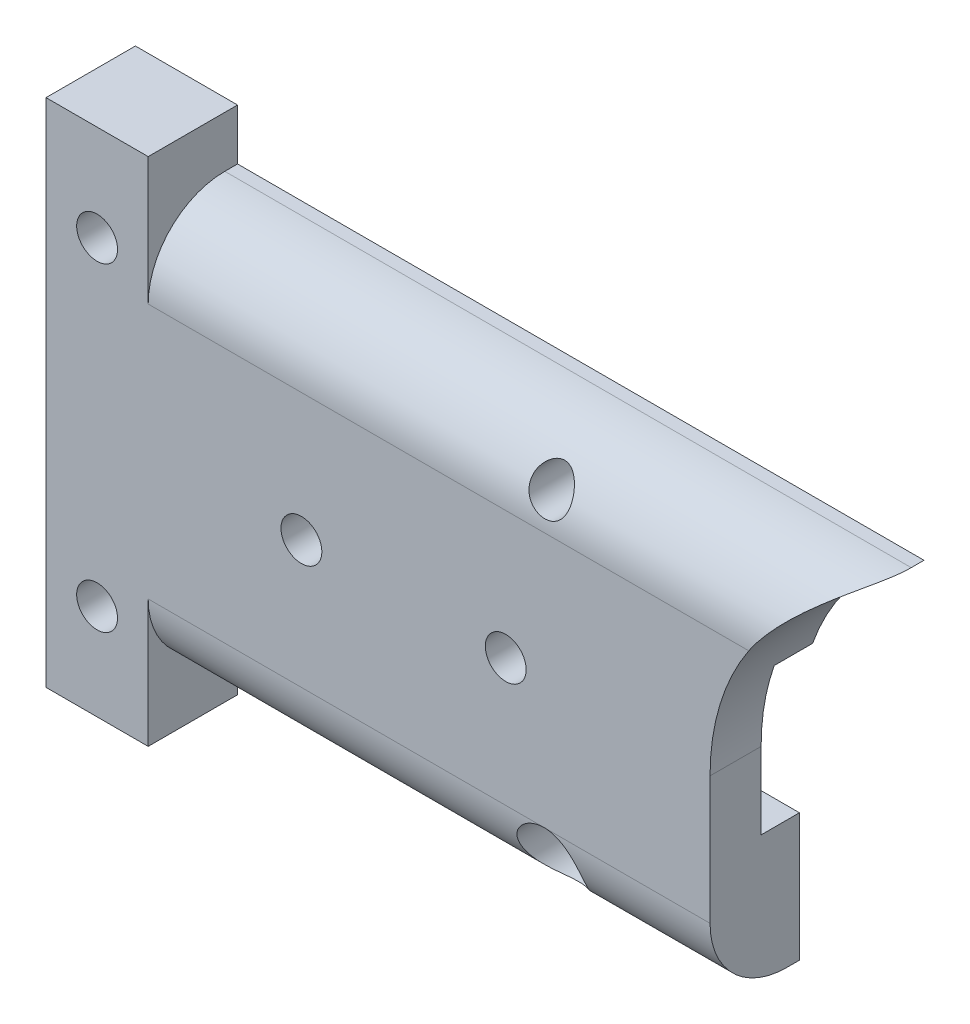
ISO-10303-21;
HEADER;
FILE_DESCRIPTION(('STEP AP214'),'2;1');
FILE_NAME('part.step','',(''),(''),'','','');
FILE_SCHEMA(('AUTOMOTIVE_DESIGN { 1 0 10303 214 1 1 1 1 }'));
ENDSEC;
DATA;
#1=APPLICATION_CONTEXT('core data for automotive mechanical design processes');
#2=APPLICATION_PROTOCOL_DEFINITION('international standard','automotive_design',2000,#1);
#3=PRODUCT_CONTEXT('',#1,'mechanical');
#4=PRODUCT('Part','Part','',(#3));
#5=PRODUCT_RELATED_PRODUCT_CATEGORY('part','',(#4));
#6=PRODUCT_DEFINITION_FORMATION('','',#4);
#7=PRODUCT_DEFINITION_CONTEXT('part definition',#1,'design');
#8=PRODUCT_DEFINITION('design','',#6,#7);
#9=PRODUCT_DEFINITION_SHAPE('','',#8);
#10=(LENGTH_UNIT() NAMED_UNIT(*) SI_UNIT(.MILLI.,.METRE.));
#11=(NAMED_UNIT(*) PLANE_ANGLE_UNIT() SI_UNIT($,.RADIAN.));
#12=(NAMED_UNIT(*) SI_UNIT($,.STERADIAN.) SOLID_ANGLE_UNIT());
#13=UNCERTAINTY_MEASURE_WITH_UNIT(LENGTH_MEASURE(1.E-05),#10,'distance_accuracy_value','');
#14=(GEOMETRIC_REPRESENTATION_CONTEXT(3) GLOBAL_UNCERTAINTY_ASSIGNED_CONTEXT((#13)) GLOBAL_UNIT_ASSIGNED_CONTEXT((#10,
#11,#12)) REPRESENTATION_CONTEXT('',''));
#15=CARTESIAN_POINT('',(0.,0.,0.));
#16=DIRECTION('',(0.,0.,1.));
#17=DIRECTION('',(1.,0.,0.));
#18=AXIS2_PLACEMENT_3D('',#15,#16,#17);
#19=CARTESIAN_POINT('',(29.6612558937557,-6.25,3.5));
#20=DIRECTION('',(0.,0.,-1.));
#21=DIRECTION('',(-1.,0.,0.));
#22=AXIS2_PLACEMENT_3D('',#19,#20,#21);
#23=CYLINDRICAL_SURFACE('',#22,0.800000000000002);
#24=CARTESIAN_POINT('',(29.6612558937557,-6.25,0.));
#25=DIRECTION('',(0.,0.,1.));
#26=DIRECTION('',(1.,0.,0.));
#27=AXIS2_PLACEMENT_3D('',#24,#25,#26);
#28=CIRCLE('',#27,0.800000000000002);
#29=CARTESIAN_POINT('',(30.4612558937557,-6.25,0.));
#30=VERTEX_POINT('',#29);
#31=EDGE_CURVE('E260',#30,#30,#28,.T.);
#32=ORIENTED_EDGE('',*,*,#31,.F.);
#33=EDGE_LOOP('',(#32));
#34=FACE_BOUND('',#33,.T.);
#35=CARTESIAN_POINT('',(29.6612558937557,-6.25,0.5));
#36=DIRECTION('',(0.,0.,1.));
#37=DIRECTION('',(1.,0.,0.));
#38=AXIS2_PLACEMENT_3D('',#35,#36,#37);
#39=CIRCLE('',#38,0.800000000000002);
#40=CARTESIAN_POINT('',(30.4612558937557,-6.25,0.5));
#41=VERTEX_POINT('',#40);
#42=EDGE_CURVE('E40',#41,#41,#39,.T.);
#43=ORIENTED_EDGE('',*,*,#42,.T.);
#44=EDGE_LOOP('',(#43));
#45=FACE_BOUND('',#44,.T.);
#46=ADVANCED_FACE('F35',(#34,#45),#23,.F.);
#47=CARTESIAN_POINT('',(0.,0.,3.5));
#48=DIRECTION('',(0.,0.,1.));
#49=DIRECTION('',(1.,0.,0.));
#50=AXIS2_PLACEMENT_3D('',#47,#48,#49);
#51=PLANE('',#50);
#52=CARTESIAN_POINT('',(12.1612558937557,-6.25,3.5));
#53=DIRECTION('',(0.,0.,1.));
#54=DIRECTION('',(1.,0.,0.));
#55=AXIS2_PLACEMENT_3D('',#52,#53,#54);
#56=CIRCLE('',#55,0.799999999999999);
#57=CARTESIAN_POINT('',(12.9612558937557,-6.25,3.5));
#58=VERTEX_POINT('',#57);
#59=EDGE_CURVE('E395',#58,#58,#56,.T.);
#60=ORIENTED_EDGE('',*,*,#59,.F.);
#61=EDGE_LOOP('',(#60));
#62=FACE_BOUND('',#61,.T.);
#63=CARTESIAN_POINT('',(12.1612558937557,6.25,3.5));
#64=DIRECTION('',(0.,0.,1.));
#65=DIRECTION('',(1.,0.,0.));
#66=AXIS2_PLACEMENT_3D('',#63,#64,#65);
#67=CIRCLE('',#66,0.799999999999999);
#68=CARTESIAN_POINT('',(12.9612558937557,6.25,3.5));
#69=VERTEX_POINT('',#68);
#70=EDGE_CURVE('E408',#69,#69,#67,.T.);
#71=ORIENTED_EDGE('',*,*,#70,.F.);
#72=EDGE_LOOP('',(#71));
#73=FACE_BOUND('',#72,.T.);
#74=DIRECTION('',(0.,1.,0.));
#75=VECTOR('',#74,1.);
#76=CARTESIAN_POINT('',(14.1612558930369,0.,3.5));
#77=LINE('',#76,#75);
#78=CARTESIAN_POINT('',(14.1612558930369,-10.,3.5));
#79=VERTEX_POINT('',#78);
#80=CARTESIAN_POINT('',(14.1612558930369,-5.,3.5));
#81=VERTEX_POINT('',#80);
#82=EDGE_CURVE('E190',#79,#81,#77,.T.);
#83=ORIENTED_EDGE('',*,*,#82,.T.);
#84=DIRECTION('',(1.,0.,0.));
#85=VECTOR('',#84,1.);
#86=CARTESIAN_POINT('',(36.1612558937557,-5.,3.5));
#87=LINE('',#86,#85);
#88=CARTESIAN_POINT('',(29.6612558937557,-5.,3.5));
#89=VERTEX_POINT('',#88);
#90=EDGE_CURVE('E265',#81,#89,#87,.T.);
#91=ORIENTED_EDGE('',*,*,#90,.T.);
#92=CARTESIAN_POINT('',(36.1612558937557,-5.,3.5));
#93=VERTEX_POINT('',#92);
#94=EDGE_CURVE('E264',#89,#93,#87,.T.);
#95=ORIENTED_EDGE('',*,*,#94,.T.);
#96=DIRECTION('',(0.,-1.,0.));
#97=VECTOR('',#96,1.);
#98=CARTESIAN_POINT('',(36.1612558937557,0.,3.5));
#99=LINE('',#98,#97);
#100=CARTESIAN_POINT('',(36.1612558937557,0.,3.5));
#101=VERTEX_POINT('',#100);
#102=EDGE_CURVE('E192',#101,#93,#99,.T.);
#103=ORIENTED_EDGE('',*,*,#102,.F.);
#104=CARTESIAN_POINT('',(45.1612558937557,0.,3.5));
#105=DIRECTION('',(0.,0.,1.));
#106=DIRECTION('',(1.,0.,0.));
#107=AXIS2_PLACEMENT_3D('',#104,#105,#106);
#108=CIRCLE('',#107,9.);
#109=CARTESIAN_POINT('',(37.6779411202078,5.,3.5));
#110=VERTEX_POINT('',#109);
#111=EDGE_CURVE('E195',#110,#101,#108,.T.);
#112=ORIENTED_EDGE('',*,*,#111,.F.);
#113=DIRECTION('',(1.,0.,0.));
#114=VECTOR('',#113,1.);
#115=CARTESIAN_POINT('',(0.,5.,3.5));
#116=LINE('',#115,#114);
#117=CARTESIAN_POINT('',(14.1612558930369,5.,3.5));
#118=VERTEX_POINT('',#117);
#119=EDGE_CURVE('E251',#110,#118,#116,.F.);
#120=ORIENTED_EDGE('',*,*,#119,.T.);
#121=DIRECTION('',(0.,-1.,0.));
#122=VECTOR('',#121,1.);
#123=CARTESIAN_POINT('',(14.1612558930369,0.,3.5));
#124=LINE('',#123,#122);
#125=CARTESIAN_POINT('',(14.1612558930369,10.,3.5));
#126=VERTEX_POINT('',#125);
#127=EDGE_CURVE('E197',#126,#118,#124,.T.);
#128=ORIENTED_EDGE('',*,*,#127,.F.);
#129=DIRECTION('',(1.,0.,0.));
#130=VECTOR('',#129,1.);
#131=CARTESIAN_POINT('',(0.,10.,3.5));
#132=LINE('',#131,#130);
#133=CARTESIAN_POINT('',(10.1612558930369,10.,3.5));
#134=VERTEX_POINT('',#133);
#135=EDGE_CURVE('E199',#134,#126,#132,.T.);
#136=ORIENTED_EDGE('',*,*,#135,.F.);
#137=DIRECTION('',(0.,1.,0.));
#138=VECTOR('',#137,1.);
#139=CARTESIAN_POINT('',(10.1612558930369,0.,3.5));
#140=LINE('',#139,#138);
#141=CARTESIAN_POINT('',(10.1612558930369,-10.,3.5));
#142=VERTEX_POINT('',#141);
#143=EDGE_CURVE('E184',#142,#134,#140,.T.);
#144=ORIENTED_EDGE('',*,*,#143,.F.);
#145=DIRECTION('',(1.,0.,0.));
#146=VECTOR('',#145,1.);
#147=CARTESIAN_POINT('',(0.,-10.,3.5));
#148=LINE('',#147,#146);
#149=EDGE_CURVE('E187',#142,#79,#148,.T.);
#150=ORIENTED_EDGE('',*,*,#149,.T.);
#151=EDGE_LOOP('',(#83,#91,#95,#103,#112,#120,#128,#136,#144,#150));
#152=FACE_BOUND('',#151,.T.);
#153=CARTESIAN_POINT('',(20.1612558937557,0.,3.5));
#154=DIRECTION('',(0.,0.,1.));
#155=DIRECTION('',(1.,0.,0.));
#156=AXIS2_PLACEMENT_3D('',#153,#154,#155);
#157=CIRCLE('',#156,0.799999999999999);
#158=CARTESIAN_POINT('',(20.9612558937557,0.,3.5));
#159=VERTEX_POINT('',#158);
#160=EDGE_CURVE('E256',#159,#159,#157,.T.);
#161=ORIENTED_EDGE('',*,*,#160,.F.);
#162=EDGE_LOOP('',(#161));
#163=FACE_BOUND('',#162,.T.);
#164=CARTESIAN_POINT('',(28.1612558937557,0.,3.5));
#165=DIRECTION('',(0.,0.,1.));
#166=DIRECTION('',(1.,0.,0.));
#167=AXIS2_PLACEMENT_3D('',#164,#165,#166);
#168=CIRCLE('',#167,0.799999999999999);
#169=CARTESIAN_POINT('',(28.9612558937557,0.,3.5));
#170=VERTEX_POINT('',#169);
#171=EDGE_CURVE('E261',#170,#170,#168,.T.);
#172=ORIENTED_EDGE('',*,*,#171,.F.);
#173=EDGE_LOOP('',(#172));
#174=FACE_BOUND('',#173,.T.);
#175=ADVANCED_FACE('F330',(#62,#73,#152,#163,#174),#51,.T.);
#176=CARTESIAN_POINT('',(0.,0.,1.5));
#177=DIRECTION('',(0.,0.,-1.));
#178=DIRECTION('',(-1.,0.,0.));
#179=AXIS2_PLACEMENT_3D('',#176,#177,#178);
#180=PLANE('',#179);
#181=CARTESIAN_POINT('',(20.1612558937557,0.,1.5));
#182=DIRECTION('',(0.,0.,-1.));
#183=DIRECTION('',(-1.,0.,0.));
#184=AXIS2_PLACEMENT_3D('',#181,#182,#183);
#185=CIRCLE('',#184,0.799999999999999);
#186=CARTESIAN_POINT('',(19.3612558937557,0.,1.5));
#187=VERTEX_POINT('',#186);
#188=EDGE_CURVE('E252',#187,#187,#185,.F.);
#189=ORIENTED_EDGE('',*,*,#188,.T.);
#190=EDGE_LOOP('',(#189));
#191=FACE_BOUND('',#190,.T.);
#192=DIRECTION('',(1.,0.,0.));
#193=VECTOR('',#192,1.);
#194=CARTESIAN_POINT('',(38.2873923506031,-3.,1.5));
#195=LINE('',#194,#193);
#196=CARTESIAN_POINT('',(10.1612558930369,-3.,1.5));
#197=VERTEX_POINT('',#196);
#198=CARTESIAN_POINT('',(36.1612558937557,-3.,1.5));
#199=VERTEX_POINT('',#198);
#200=EDGE_CURVE('E164',#197,#199,#195,.T.);
#201=ORIENTED_EDGE('',*,*,#200,.F.);
#202=DIRECTION('',(0.,-1.,0.));
#203=VECTOR('',#202,1.);
#204=CARTESIAN_POINT('',(10.1612558930369,3.,1.5));
#205=LINE('',#204,#203);
#206=CARTESIAN_POINT('',(10.1612558930369,3.,1.5));
#207=VERTEX_POINT('',#206);
#208=EDGE_CURVE('E156',#207,#197,#205,.T.);
#209=ORIENTED_EDGE('',*,*,#208,.F.);
#210=DIRECTION('',(-1.,0.,0.));
#211=VECTOR('',#210,1.);
#212=CARTESIAN_POINT('',(10.1612558930369,3.,1.5));
#213=LINE('',#212,#211);
#214=CARTESIAN_POINT('',(36.6759745195172,3.,1.5));
#215=VERTEX_POINT('',#214);
#216=EDGE_CURVE('E146',#215,#207,#213,.T.);
#217=ORIENTED_EDGE('',*,*,#216,.F.);
#218=CARTESIAN_POINT('',(45.1612558937557,0.,1.5));
#219=DIRECTION('',(0.,0.,-1.));
#220=DIRECTION('',(-1.,0.,0.));
#221=AXIS2_PLACEMENT_3D('',#218,#219,#220);
#222=CIRCLE('',#221,9.);
#223=CARTESIAN_POINT('',(36.1612558937557,0.,1.5));
#224=VERTEX_POINT('',#223);
#225=EDGE_CURVE('E249',#224,#215,#222,.T.);
#226=ORIENTED_EDGE('',*,*,#225,.F.);
#227=DIRECTION('',(0.,1.,0.));
#228=VECTOR('',#227,1.);
#229=CARTESIAN_POINT('',(36.1612558937557,0.,1.5));
#230=LINE('',#229,#228);
#231=EDGE_CURVE('E181',#199,#224,#230,.T.);
#232=ORIENTED_EDGE('',*,*,#231,.F.);
#233=EDGE_LOOP('',(#201,#209,#217,#226,#232));
#234=FACE_BOUND('',#233,.T.);
#235=CARTESIAN_POINT('',(28.1612558937557,0.,1.5));
#236=DIRECTION('',(0.,0.,-1.));
#237=DIRECTION('',(-1.,0.,0.));
#238=AXIS2_PLACEMENT_3D('',#235,#236,#237);
#239=CIRCLE('',#238,0.799999999999999);
#240=CARTESIAN_POINT('',(27.3612558937557,0.,1.5));
#241=VERTEX_POINT('',#240);
#242=EDGE_CURVE('E257',#241,#241,#239,.F.);
#243=ORIENTED_EDGE('',*,*,#242,.T.);
#244=EDGE_LOOP('',(#243));
#245=FACE_BOUND('',#244,.T.);
#246=ADVANCED_FACE('F161',(#191,#234,#245),#180,.T.);
#247=CARTESIAN_POINT('',(0.,0.,0.));
#248=DIRECTION('',(0.,0.,1.));
#249=DIRECTION('',(1.,0.,0.));
#250=AXIS2_PLACEMENT_3D('',#247,#248,#249);
#251=PLANE('',#250);
#252=CARTESIAN_POINT('',(12.1612558937557,-6.25,0.));
#253=DIRECTION('',(0.,0.,1.));
#254=DIRECTION('',(1.,0.,0.));
#255=AXIS2_PLACEMENT_3D('',#252,#253,#254);
#256=CIRCLE('',#255,0.799999999999999);
#257=CARTESIAN_POINT('',(12.9612558937557,-6.25,0.));
#258=VERTEX_POINT('',#257);
#259=EDGE_CURVE('E392',#258,#258,#256,.T.);
#260=ORIENTED_EDGE('',*,*,#259,.T.);
#261=EDGE_LOOP('',(#260));
#262=FACE_BOUND('',#261,.T.);
#263=DIRECTION('',(1.,0.,0.));
#264=VECTOR('',#263,1.);
#265=CARTESIAN_POINT('',(38.2873923506031,-3.,0.));
#266=LINE('',#265,#264);
#267=CARTESIAN_POINT('',(10.1612558930369,-3.,0.));
#268=VERTEX_POINT('',#267);
#269=CARTESIAN_POINT('',(36.1612558937557,-3.,0.));
#270=VERTEX_POINT('',#269);
#271=EDGE_CURVE('E157',#268,#270,#266,.T.);
#272=ORIENTED_EDGE('',*,*,#271,.T.);
#273=DIRECTION('',(0.,-1.,0.));
#274=VECTOR('',#273,1.);
#275=CARTESIAN_POINT('',(36.1612558937557,0.,0.));
#276=LINE('',#275,#274);
#277=CARTESIAN_POINT('',(36.1612558937557,-8.,0.));
#278=VERTEX_POINT('',#277);
#279=EDGE_CURVE('E214',#270,#278,#276,.T.);
#280=ORIENTED_EDGE('',*,*,#279,.T.);
#281=DIRECTION('',(1.,0.,0.));
#282=VECTOR('',#281,1.);
#283=CARTESIAN_POINT('',(0.,-8.,0.));
#284=LINE('',#283,#282);
#285=CARTESIAN_POINT('',(14.1612558930369,-8.,0.));
#286=VERTEX_POINT('',#285);
#287=EDGE_CURVE('E211',#286,#278,#284,.T.);
#288=ORIENTED_EDGE('',*,*,#287,.F.);
#289=DIRECTION('',(0.,1.,0.));
#290=VECTOR('',#289,1.);
#291=CARTESIAN_POINT('',(14.1612558930369,0.,0.));
#292=LINE('',#291,#290);
#293=CARTESIAN_POINT('',(14.1612558930369,-10.,0.));
#294=VERTEX_POINT('',#293);
#295=EDGE_CURVE('E208',#294,#286,#292,.T.);
#296=ORIENTED_EDGE('',*,*,#295,.F.);
#297=DIRECTION('',(1.,0.,0.));
#298=VECTOR('',#297,1.);
#299=CARTESIAN_POINT('',(0.,-10.,0.));
#300=LINE('',#299,#298);
#301=CARTESIAN_POINT('',(10.1612558930369,-10.,0.));
#302=VERTEX_POINT('',#301);
#303=EDGE_CURVE('E206',#302,#294,#300,.T.);
#304=ORIENTED_EDGE('',*,*,#303,.F.);
#305=DIRECTION('',(0.,1.,0.));
#306=VECTOR('',#305,1.);
#307=CARTESIAN_POINT('',(10.1612558930369,0.,0.));
#308=LINE('',#307,#306);
#309=EDGE_CURVE('E203',#302,#268,#308,.T.);
#310=ORIENTED_EDGE('',*,*,#309,.T.);
#311=EDGE_LOOP('',(#272,#280,#288,#296,#304,#310));
#312=FACE_BOUND('',#311,.T.);
#313=ORIENTED_EDGE('',*,*,#31,.T.);
#314=EDGE_LOOP('',(#313));
#315=FACE_BOUND('',#314,.T.);
#316=ADVANCED_FACE('F351',(#262,#312,#315),#251,.F.);
#317=CARTESIAN_POINT('',(12.1612558937557,6.25,0.));
#318=DIRECTION('',(0.,0.,1.));
#319=DIRECTION('',(1.,0.,0.));
#320=AXIS2_PLACEMENT_3D('',#317,#318,#319);
#321=CIRCLE('',#320,0.799999999999999);
#322=CARTESIAN_POINT('',(12.9612558937557,6.25,0.));
#323=VERTEX_POINT('',#322);
#324=EDGE_CURVE('E255',#323,#323,#321,.T.);
#325=ORIENTED_EDGE('',*,*,#324,.T.);
#326=EDGE_LOOP('',(#325));
#327=FACE_BOUND('',#326,.T.);
#328=DIRECTION('',(1.,0.,0.));
#329=VECTOR('',#328,1.);
#330=CARTESIAN_POINT('',(0.,3.,0.));
#331=LINE('',#330,#329);
#332=CARTESIAN_POINT('',(10.1612558930369,3.,0.));
#333=VERTEX_POINT('',#332);
#334=CARTESIAN_POINT('',(36.6759745195172,3.,0.));
#335=VERTEX_POINT('',#334);
#336=EDGE_CURVE('E247',#333,#335,#331,.T.);
#337=ORIENTED_EDGE('',*,*,#336,.F.);
#338=CARTESIAN_POINT('',(10.1612558930369,10.,0.));
#339=VERTEX_POINT('',#338);
#340=EDGE_CURVE('E171',#333,#339,#308,.T.);
#341=ORIENTED_EDGE('',*,*,#340,.T.);
#342=DIRECTION('',(1.,0.,0.));
#343=VECTOR('',#342,1.);
#344=CARTESIAN_POINT('',(0.,10.,0.));
#345=LINE('',#344,#343);
#346=CARTESIAN_POINT('',(14.1612558930369,10.,0.));
#347=VERTEX_POINT('',#346);
#348=EDGE_CURVE('E188',#339,#347,#345,.T.);
#349=ORIENTED_EDGE('',*,*,#348,.T.);
#350=DIRECTION('',(0.,-1.,0.));
#351=VECTOR('',#350,1.);
#352=CARTESIAN_POINT('',(14.1612558930369,0.,0.));
#353=LINE('',#352,#351);
#354=CARTESIAN_POINT('',(14.1612558930369,8.,0.));
#355=VERTEX_POINT('',#354);
#356=EDGE_CURVE('E223',#347,#355,#353,.T.);
#357=ORIENTED_EDGE('',*,*,#356,.T.);
#358=DIRECTION('',(1.,0.,0.));
#359=VECTOR('',#358,1.);
#360=CARTESIAN_POINT('',(0.,8.,0.));
#361=LINE('',#360,#359);
#362=CARTESIAN_POINT('',(41.0381502681381,8.,0.));
#363=VERTEX_POINT('',#362);
#364=EDGE_CURVE('E220',#355,#363,#361,.T.);
#365=ORIENTED_EDGE('',*,*,#364,.T.);
#366=CARTESIAN_POINT('',(45.1612558937557,0.,0.));
#367=DIRECTION('',(0.,0.,1.));
#368=DIRECTION('',(1.,0.,0.));
#369=AXIS2_PLACEMENT_3D('',#366,#367,#368);
#370=CIRCLE('',#369,9.);
#371=EDGE_CURVE('E217',#363,#335,#370,.T.);
#372=ORIENTED_EDGE('',*,*,#371,.T.);
#373=EDGE_LOOP('',(#337,#341,#349,#357,#365,#372));
#374=FACE_BOUND('',#373,.T.);
#375=CARTESIAN_POINT('',(29.6612558937557,6.25,0.));
#376=DIRECTION('',(0.,0.,1.));
#377=DIRECTION('',(1.,0.,0.));
#378=AXIS2_PLACEMENT_3D('',#375,#376,#377);
#379=CIRCLE('',#378,0.800000000000002);
#380=CARTESIAN_POINT('',(30.4612558937557,6.25,0.));
#381=VERTEX_POINT('',#380);
#382=EDGE_CURVE('E393',#381,#381,#379,.T.);
#383=ORIENTED_EDGE('',*,*,#382,.T.);
#384=EDGE_LOOP('',(#383));
#385=FACE_BOUND('',#384,.T.);
#386=ADVANCED_FACE('F304',(#327,#374,#385),#251,.F.);
#387=CARTESIAN_POINT('',(10.1612558930369,0.,3.5));
#388=DIRECTION('',(-1.,0.,0.));
#389=DIRECTION('',(0.,0.,1.));
#390=AXIS2_PLACEMENT_3D('',#387,#388,#389);
#391=PLANE('',#390);
#392=ORIENTED_EDGE('',*,*,#340,.F.);
#393=DIRECTION('',(0.,0.,-1.));
#394=VECTOR('',#393,1.);
#395=CARTESIAN_POINT('',(10.1612558930369,3.,1.5));
#396=LINE('',#395,#394);
#397=EDGE_CURVE('E150',#207,#333,#396,.T.);
#398=ORIENTED_EDGE('',*,*,#397,.F.);
#399=ORIENTED_EDGE('',*,*,#208,.T.);
#400=DIRECTION('',(0.,0.,-1.));
#401=VECTOR('',#400,1.);
#402=CARTESIAN_POINT('',(10.1612558930369,-3.,1.5));
#403=LINE('',#402,#401);
#404=EDGE_CURVE('E173',#197,#268,#403,.T.);
#405=ORIENTED_EDGE('',*,*,#404,.T.);
#406=ORIENTED_EDGE('',*,*,#309,.F.);
#407=DIRECTION('',(0.,0.,-1.));
#408=VECTOR('',#407,1.);
#409=CARTESIAN_POINT('',(10.1612558930369,-10.,3.5));
#410=LINE('',#409,#408);
#411=EDGE_CURVE('E245',#142,#302,#410,.T.);
#412=ORIENTED_EDGE('',*,*,#411,.F.);
#413=ORIENTED_EDGE('',*,*,#143,.T.);
#414=DIRECTION('',(0.,0.,-1.));
#415=VECTOR('',#414,1.);
#416=CARTESIAN_POINT('',(10.1612558930369,10.,3.5));
#417=LINE('',#416,#415);
#418=EDGE_CURVE('E202',#134,#339,#417,.T.);
#419=ORIENTED_EDGE('',*,*,#418,.T.);
#420=EDGE_LOOP('',(#392,#398,#399,#405,#406,#412,#413,#419));
#421=FACE_BOUND('',#420,.T.);
#422=ADVANCED_FACE('F169',(#421),#391,.T.);
#423=CARTESIAN_POINT('',(36.1612558937557,0.,3.5));
#424=DIRECTION('',(1.,0.,0.));
#425=DIRECTION('',(0.,0.,-1.));
#426=AXIS2_PLACEMENT_3D('',#423,#424,#425);
#427=PLANE('',#426);
#428=ORIENTED_EDGE('',*,*,#102,.T.);
#429=CARTESIAN_POINT('',(36.1612558937557,-5.,0.5));
#430=DIRECTION('',(1.,0.,0.));
#431=DIRECTION('',(0.,0.,-1.));
#432=AXIS2_PLACEMENT_3D('',#429,#430,#431);
#433=CIRCLE('',#432,3.);
#434=CARTESIAN_POINT('',(36.1612558937557,-8.,0.5));
#435=VERTEX_POINT('',#434);
#436=EDGE_CURVE('E268',#93,#435,#433,.T.);
#437=ORIENTED_EDGE('',*,*,#436,.T.);
#438=DIRECTION('',(0.,0.,-1.));
#439=VECTOR('',#438,1.);
#440=CARTESIAN_POINT('',(36.1612558937557,-8.,3.5));
#441=LINE('',#440,#439);
#442=EDGE_CURVE('E238',#435,#278,#441,.T.);
#443=ORIENTED_EDGE('',*,*,#442,.T.);
#444=ORIENTED_EDGE('',*,*,#279,.F.);
#445=DIRECTION('',(0.,0.,1.));
#446=VECTOR('',#445,1.);
#447=CARTESIAN_POINT('',(36.1612558937557,-3.,3.5));
#448=LINE('',#447,#446);
#449=EDGE_CURVE('E172',#270,#199,#448,.T.);
#450=ORIENTED_EDGE('',*,*,#449,.T.);
#451=ORIENTED_EDGE('',*,*,#231,.T.);
#452=DIRECTION('',(0.,0.,-1.));
#453=VECTOR('',#452,1.);
#454=CARTESIAN_POINT('',(36.1612558937557,0.,3.5));
#455=LINE('',#454,#453);
#456=EDGE_CURVE('E235',#101,#224,#455,.T.);
#457=ORIENTED_EDGE('',*,*,#456,.F.);
#458=EDGE_LOOP('',(#428,#437,#443,#444,#450,#451,#457));
#459=FACE_BOUND('',#458,.T.);
#460=ADVANCED_FACE('F285',(#459),#427,.T.);
#461=CARTESIAN_POINT('',(45.1612558937557,0.,3.5));
#462=DIRECTION('',(0.,0.,-1.));
#463=DIRECTION('',(-1.,0.,0.));
#464=AXIS2_PLACEMENT_3D('',#461,#462,#463);
#465=CYLINDRICAL_SURFACE('',#464,9.);
#466=DIRECTION('',(0.,0.,-1.));
#467=VECTOR('',#466,1.);
#468=CARTESIAN_POINT('',(41.0381502681381,8.,3.5));
#469=LINE('',#468,#467);
#470=CARTESIAN_POINT('',(41.0381502681381,8.,0.5));
#471=VERTEX_POINT('',#470);
#472=EDGE_CURVE('E233',#471,#363,#469,.T.);
#473=ORIENTED_EDGE('',*,*,#472,.F.);
#474=CARTESIAN_POINT('',(41.0381502681381,8.,0.5));
#475=CARTESIAN_POINT('',(41.0381689179631,8.00000682227174,0.543892395628932));
#476=CARTESIAN_POINT('',(41.036279780118,7.99903616094687,0.587756978677625));
#477=CARTESIAN_POINT('',(41.0288594651456,7.99520651349171,0.675025806607922));
#478=CARTESIAN_POINT('',(41.0233340823201,7.99235053156921,0.718430672417365));
#479=CARTESIAN_POINT('',(41.0017706434738,7.98116206779442,0.846273758984881));
#480=CARTESIAN_POINT('',(40.9807341504967,7.9702045816596,0.929669831404689));
#481=CARTESIAN_POINT('',(40.9191025919232,7.93761187136101,1.11840333609769));
#482=CARTESIAN_POINT('',(40.8743489328409,7.9136492146137,1.22192779167978));
#483=CARTESIAN_POINT('',(40.7717654849429,7.85721406813074,1.42036876517337));
#484=CARTESIAN_POINT('',(40.7138470532919,7.82468364145973,1.51522051756623));
#485=CARTESIAN_POINT('',(40.5969214840671,7.75698980561336,1.68592726213608));
#486=CARTESIAN_POINT('',(40.5388134682619,7.72256498184409,1.76271088681093));
#487=CARTESIAN_POINT('',(40.4181786603415,7.6490660815231,1.91041083472654));
#488=CARTESIAN_POINT('',(40.3556485020354,7.60998844738373,1.981322597129));
#489=CARTESIAN_POINT('',(40.2275580199533,7.52757849620045,2.11793633166739));
#490=CARTESIAN_POINT('',(40.1619931711666,7.48423970963716,2.18363009944237));
#491=CARTESIAN_POINT('',(40.0289136789524,7.39361569367952,2.31015390463297));
#492=CARTESIAN_POINT('',(39.9613985100782,7.3463293941549,2.37098261437331));
#493=CARTESIAN_POINT('',(39.7907898854287,7.22316087011483,2.51762332228178));
#494=CARTESIAN_POINT('',(39.6869329142095,7.14488835170173,2.60055529120883));
#495=CARTESIAN_POINT('',(39.4783052621444,6.98009821825219,2.75656368906588));
#496=CARTESIAN_POINT('',(39.3735342043483,6.89357703996323,2.82963582552767));
#497=CARTESIAN_POINT('',(39.1647281502435,6.71272537594979,2.9656309020575));
#498=CARTESIAN_POINT('',(39.0606919459086,6.61841588888703,3.02857986565086));
#499=CARTESIAN_POINT('',(38.8542342663129,6.42197598382052,3.1440420287277));
#500=CARTESIAN_POINT('',(38.7518124913914,6.31984703833233,3.19655718638222));
#501=CARTESIAN_POINT('',(38.5640927261045,6.12316797037191,3.28358449720449));
#502=CARTESIAN_POINT('',(38.4784393372195,6.02962051918063,3.3195969222343));
#503=CARTESIAN_POINT('',(38.3097967323572,5.83728222710133,3.38256706565178));
#504=CARTESIAN_POINT('',(38.2268062930351,5.73849385085576,3.40952899724988));
#505=CARTESIAN_POINT('',(38.0637640651291,5.53557461163182,3.45363992149952));
#506=CARTESIAN_POINT('',(37.9837278845465,5.43142086503674,3.47074229769674));
#507=CARTESIAN_POINT('',(37.8276290826603,5.2187615849908,3.49392557027441));
#508=CARTESIAN_POINT('',(37.7515727074795,5.11024965699026,3.4999896183084));
#509=CARTESIAN_POINT('',(37.6779411202078,5.,3.5));
#510=B_SPLINE_CURVE_WITH_KNOTS('',3,(#474,#475,#476,#477,#478,#479,#480,#481,#482,#483,#484,
#485,#486,#487,#488,#489,#490,#491,#492,#493,#494,#495,#496,#497,#498,#499,#500,#501,#502,#503,
#504,#505,#506,#507,#508,#509),.UNSPECIFIED.,.F.,.F.,(4,2,2,2,2,2,2,2,2,2,2,2,2,2,2,2,2,4),(0.,
0.131576184151806,0.262943209655054,0.521751049950021,0.86574445388039,1.21212655279035,
1.51848404847241,1.82507731101722,2.13214346761401,2.43929313870561,2.90141635811029,
3.36374011772486,3.82485570253338,4.28588466527002,4.68102895931083,5.07598904876777,
5.47280152903258,5.87021917757067),.UNSPECIFIED.);
#511=EDGE_CURVE('E58',#471,#110,#510,.T.);
#512=ORIENTED_EDGE('',*,*,#511,.T.);
#513=ORIENTED_EDGE('',*,*,#111,.T.);
#514=ORIENTED_EDGE('',*,*,#456,.T.);
#515=ORIENTED_EDGE('',*,*,#225,.T.);
#516=DIRECTION('',(0.,0.,-1.));
#517=VECTOR('',#516,1.);
#518=CARTESIAN_POINT('',(36.6759745195172,3.,3.5));
#519=LINE('',#518,#517);
#520=EDGE_CURVE('E153',#215,#335,#519,.T.);
#521=ORIENTED_EDGE('',*,*,#520,.T.);
#522=ORIENTED_EDGE('',*,*,#371,.F.);
#523=EDGE_LOOP('',(#473,#512,#513,#514,#515,#521,#522));
#524=FACE_BOUND('',#523,.T.);
#525=ADVANCED_FACE('F279',(#524),#465,.F.);
#526=CARTESIAN_POINT('',(0.,-10.,3.5));
#527=DIRECTION('',(0.,1.,0.));
#528=DIRECTION('',(0.,0.,1.));
#529=AXIS2_PLACEMENT_3D('',#526,#527,#528);
#530=PLANE('',#529);
#531=ORIENTED_EDGE('',*,*,#303,.T.);
#532=DIRECTION('',(0.,0.,-1.));
#533=VECTOR('',#532,1.);
#534=CARTESIAN_POINT('',(14.1612558930369,-10.,3.5));
#535=LINE('',#534,#533);
#536=EDGE_CURVE('E242',#79,#294,#535,.T.);
#537=ORIENTED_EDGE('',*,*,#536,.F.);
#538=ORIENTED_EDGE('',*,*,#149,.F.);
#539=ORIENTED_EDGE('',*,*,#411,.T.);
#540=EDGE_LOOP('',(#531,#537,#538,#539));
#541=FACE_BOUND('',#540,.T.);
#542=ADVANCED_FACE('F284',(#541),#530,.F.);
#543=CARTESIAN_POINT('',(14.1612558930369,0.,3.5));
#544=DIRECTION('',(-1.,0.,0.));
#545=DIRECTION('',(0.,0.,1.));
#546=AXIS2_PLACEMENT_3D('',#543,#544,#545);
#547=PLANE('',#546);
#548=ORIENTED_EDGE('',*,*,#295,.T.);
#549=DIRECTION('',(0.,0.,-1.));
#550=VECTOR('',#549,1.);
#551=CARTESIAN_POINT('',(14.1612558930369,-8.,3.5));
#552=LINE('',#551,#550);
#553=CARTESIAN_POINT('',(14.1612558930369,-8.,0.5));
#554=VERTEX_POINT('',#553);
#555=EDGE_CURVE('E240',#554,#286,#552,.T.);
#556=ORIENTED_EDGE('',*,*,#555,.F.);
#557=CARTESIAN_POINT('',(14.1612558930369,-5.,0.5));
#558=DIRECTION('',(-1.,0.,0.));
#559=DIRECTION('',(0.,0.,1.));
#560=AXIS2_PLACEMENT_3D('',#557,#558,#559);
#561=CIRCLE('',#560,3.);
#562=EDGE_CURVE('E45',#554,#81,#561,.T.);
#563=ORIENTED_EDGE('',*,*,#562,.T.);
#564=ORIENTED_EDGE('',*,*,#82,.F.);
#565=ORIENTED_EDGE('',*,*,#536,.T.);
#566=EDGE_LOOP('',(#548,#556,#563,#564,#565));
#567=FACE_BOUND('',#566,.T.);
#568=ADVANCED_FACE('F295',(#567),#547,.F.);
#569=CARTESIAN_POINT('',(0.,-8.,3.5));
#570=DIRECTION('',(0.,1.,0.));
#571=DIRECTION('',(0.,0.,1.));
#572=AXIS2_PLACEMENT_3D('',#569,#570,#571);
#573=PLANE('',#572);
#574=ORIENTED_EDGE('',*,*,#442,.F.);
#575=DIRECTION('',(1.,0.,0.));
#576=VECTOR('',#575,1.);
#577=CARTESIAN_POINT('',(14.1612558930369,-8.,0.5));
#578=LINE('',#577,#576);
#579=EDGE_CURVE('E270',#435,#554,#578,.F.);
#580=ORIENTED_EDGE('',*,*,#579,.T.);
#581=ORIENTED_EDGE('',*,*,#555,.T.);
#582=ORIENTED_EDGE('',*,*,#287,.T.);
#583=EDGE_LOOP('',(#574,#580,#581,#582));
#584=FACE_BOUND('',#583,.T.);
#585=ADVANCED_FACE('F292',(#584),#573,.F.);
#586=CARTESIAN_POINT('',(0.,8.,3.5));
#587=DIRECTION('',(0.,1.,0.));
#588=DIRECTION('',(0.,0.,1.));
#589=AXIS2_PLACEMENT_3D('',#586,#587,#588);
#590=PLANE('',#589);
#591=DIRECTION('',(0.,0.,-1.));
#592=VECTOR('',#591,1.);
#593=CARTESIAN_POINT('',(14.1612558930369,8.,3.5));
#594=LINE('',#593,#592);
#595=CARTESIAN_POINT('',(14.1612558930369,8.,0.5));
#596=VERTEX_POINT('',#595);
#597=EDGE_CURVE('E231',#596,#355,#594,.T.);
#598=ORIENTED_EDGE('',*,*,#597,.F.);
#599=DIRECTION('',(1.,0.,0.));
#600=VECTOR('',#599,1.);
#601=CARTESIAN_POINT('',(0.,8.,0.5));
#602=LINE('',#601,#600);
#603=EDGE_CURVE('E272',#596,#471,#602,.T.);
#604=ORIENTED_EDGE('',*,*,#603,.T.);
#605=ORIENTED_EDGE('',*,*,#472,.T.);
#606=ORIENTED_EDGE('',*,*,#364,.F.);
#607=EDGE_LOOP('',(#598,#604,#605,#606));
#608=FACE_BOUND('',#607,.T.);
#609=ADVANCED_FACE('F287',(#608),#590,.T.);
#610=CARTESIAN_POINT('',(14.1612558930369,0.,3.5));
#611=DIRECTION('',(1.,0.,0.));
#612=DIRECTION('',(0.,0.,-1.));
#613=AXIS2_PLACEMENT_3D('',#610,#611,#612);
#614=PLANE('',#613);
#615=ORIENTED_EDGE('',*,*,#356,.F.);
#616=DIRECTION('',(0.,0.,-1.));
#617=VECTOR('',#616,1.);
#618=CARTESIAN_POINT('',(14.1612558930369,10.,3.5));
#619=LINE('',#618,#617);
#620=EDGE_CURVE('E229',#126,#347,#619,.T.);
#621=ORIENTED_EDGE('',*,*,#620,.F.);
#622=ORIENTED_EDGE('',*,*,#127,.T.);
#623=CARTESIAN_POINT('',(14.1612558930369,5.,0.5));
#624=DIRECTION('',(1.,0.,0.));
#625=DIRECTION('',(0.,0.,-1.));
#626=AXIS2_PLACEMENT_3D('',#623,#624,#625);
#627=CIRCLE('',#626,3.);
#628=EDGE_CURVE('E11',#118,#596,#627,.F.);
#629=ORIENTED_EDGE('',*,*,#628,.T.);
#630=ORIENTED_EDGE('',*,*,#597,.T.);
#631=EDGE_LOOP('',(#615,#621,#622,#629,#630));
#632=FACE_BOUND('',#631,.T.);
#633=ADVANCED_FACE('F366',(#632),#614,.T.);
#634=CARTESIAN_POINT('',(0.,10.,3.5));
#635=DIRECTION('',(0.,1.,0.));
#636=DIRECTION('',(0.,0.,1.));
#637=AXIS2_PLACEMENT_3D('',#634,#635,#636);
#638=PLANE('',#637);
#639=ORIENTED_EDGE('',*,*,#348,.F.);
#640=ORIENTED_EDGE('',*,*,#418,.F.);
#641=ORIENTED_EDGE('',*,*,#135,.T.);
#642=ORIENTED_EDGE('',*,*,#620,.T.);
#643=EDGE_LOOP('',(#639,#640,#641,#642));
#644=FACE_BOUND('',#643,.T.);
#645=ADVANCED_FACE('F358',(#644),#638,.T.);
#646=CARTESIAN_POINT('',(10.1612558930369,3.,1.5));
#647=DIRECTION('',(0.,-1.,0.));
#648=DIRECTION('',(0.,0.,-1.));
#649=AXIS2_PLACEMENT_3D('',#646,#647,#648);
#650=PLANE('',#649);
#651=ORIENTED_EDGE('',*,*,#216,.T.);
#652=ORIENTED_EDGE('',*,*,#397,.T.);
#653=ORIENTED_EDGE('',*,*,#336,.T.);
#654=ORIENTED_EDGE('',*,*,#520,.F.);
#655=EDGE_LOOP('',(#651,#652,#653,#654));
#656=FACE_BOUND('',#655,.T.);
#657=ADVANCED_FACE('F148',(#656),#650,.T.);
#658=CARTESIAN_POINT('',(38.2873923506031,-3.,1.5));
#659=DIRECTION('',(0.,1.,0.));
#660=DIRECTION('',(0.,0.,1.));
#661=AXIS2_PLACEMENT_3D('',#658,#659,#660);
#662=PLANE('',#661);
#663=ORIENTED_EDGE('',*,*,#271,.F.);
#664=ORIENTED_EDGE('',*,*,#404,.F.);
#665=ORIENTED_EDGE('',*,*,#200,.T.);
#666=ORIENTED_EDGE('',*,*,#449,.F.);
#667=EDGE_LOOP('',(#663,#664,#665,#666));
#668=FACE_BOUND('',#667,.T.);
#669=ADVANCED_FACE('F347',(#668),#662,.T.);
#670=CARTESIAN_POINT('',(12.1612558937557,6.25,3.5));
#671=DIRECTION('',(0.,0.,-1.));
#672=DIRECTION('',(-1.,0.,0.));
#673=AXIS2_PLACEMENT_3D('',#670,#671,#672);
#674=CYLINDRICAL_SURFACE('',#673,0.799999999999999);
#675=ORIENTED_EDGE('',*,*,#70,.T.);
#676=EDGE_LOOP('',(#675));
#677=FACE_BOUND('',#676,.T.);
#678=ORIENTED_EDGE('',*,*,#324,.F.);
#679=EDGE_LOOP('',(#678));
#680=FACE_BOUND('',#679,.T.);
#681=ADVANCED_FACE('F343',(#677,#680),#674,.F.);
#682=CARTESIAN_POINT('',(20.1612558937557,0.,3.5));
#683=DIRECTION('',(0.,0.,-1.));
#684=DIRECTION('',(-1.,0.,0.));
#685=AXIS2_PLACEMENT_3D('',#682,#683,#684);
#686=CYLINDRICAL_SURFACE('',#685,0.799999999999999);
#687=ORIENTED_EDGE('',*,*,#188,.F.);
#688=EDGE_LOOP('',(#687));
#689=FACE_BOUND('',#688,.T.);
#690=ORIENTED_EDGE('',*,*,#160,.T.);
#691=EDGE_LOOP('',(#690));
#692=FACE_BOUND('',#691,.T.);
#693=ADVANCED_FACE('F339',(#689,#692),#686,.F.);
#694=CARTESIAN_POINT('',(12.1612558937557,-6.25,3.5));
#695=DIRECTION('',(0.,0.,-1.));
#696=DIRECTION('',(-1.,0.,0.));
#697=AXIS2_PLACEMENT_3D('',#694,#695,#696);
#698=CYLINDRICAL_SURFACE('',#697,0.799999999999999);
#699=ORIENTED_EDGE('',*,*,#59,.T.);
#700=EDGE_LOOP('',(#699));
#701=FACE_BOUND('',#700,.T.);
#702=ORIENTED_EDGE('',*,*,#259,.F.);
#703=EDGE_LOOP('',(#702));
#704=FACE_BOUND('',#703,.T.);
#705=ADVANCED_FACE('F335',(#701,#704),#698,.F.);
#706=CARTESIAN_POINT('',(29.6612558937557,6.25,3.5));
#707=DIRECTION('',(0.,0.,-1.));
#708=DIRECTION('',(-1.,0.,0.));
#709=AXIS2_PLACEMENT_3D('',#706,#707,#708);
#710=CYLINDRICAL_SURFACE('',#709,0.800000000000002);
#711=CARTESIAN_POINT('',(28.8669898601777,6.15438897602879,3.26900453087818));
#712=CARTESIAN_POINT('',(28.8721311828365,6.11169483679406,3.28680209511132));
#713=CARTESIAN_POINT('',(28.8807848974327,6.06890079246859,3.30347394033703));
#714=CARTESIAN_POINT('',(28.9053411552492,5.98442384473988,3.33424350079898));
#715=CARTESIAN_POINT('',(28.9212520598615,5.94274228188297,3.34833822047955));
#716=CARTESIAN_POINT('',(28.9602735524653,5.86187376291655,3.37384326383375));
#717=CARTESIAN_POINT('',(28.9833989561083,5.82269214194794,3.38524797791654));
#718=CARTESIAN_POINT('',(29.0363669774552,5.74840891809945,3.40540323419782));
#719=CARTESIAN_POINT('',(29.0662072424179,5.71330589268502,3.41415470352056));
#720=CARTESIAN_POINT('',(29.1303973854104,5.64988419624695,3.42893646972115));
#721=CARTESIAN_POINT('',(29.1645035678959,5.62134160293291,3.43506608536596));
#722=CARTESIAN_POINT('',(29.2371712742558,5.57020155021597,3.44542920991306));
#723=CARTESIAN_POINT('',(29.2757327030689,5.54760396399857,3.44966275926218));
#724=CARTESIAN_POINT('',(29.3557032337734,5.50933870986977,3.45650962174962));
#725=CARTESIAN_POINT('',(29.3970721882027,5.49359042277221,3.45914193790946));
#726=CARTESIAN_POINT('',(29.4818963966681,5.46911668795983,3.46312072268791));
#727=CARTESIAN_POINT('',(29.5253516643638,5.4603912862327,3.46446718288641));
#728=CARTESIAN_POINT('',(29.6133123699181,5.45020629805913,3.4660312822679));
#729=CARTESIAN_POINT('',(29.6578214789455,5.4487776719662,3.4662441115975));
#730=CARTESIAN_POINT('',(29.7464536486816,5.45331283240704,3.46555432768538));
#731=CARTESIAN_POINT('',(29.7905767012725,5.45927677401339,3.46465169104473));
#732=CARTESIAN_POINT('',(29.8772742982069,5.47843617298061,3.46161985400861));
#733=CARTESIAN_POINT('',(29.9198455576452,5.49164611712715,3.45948819601801));
#734=CARTESIAN_POINT('',(30.0021268029643,5.52489609064499,3.45377164459904));
#735=CARTESIAN_POINT('',(30.0418368922732,5.54493587297468,3.45018680373277));
#736=CARTESIAN_POINT('',(30.1171394216566,5.59112603588617,3.44127849441294));
#737=CARTESIAN_POINT('',(30.152744386403,5.61725705291913,3.43596051457613));
#738=CARTESIAN_POINT('',(30.2189788984662,5.67478796701311,3.42327319562138));
#739=CARTESIAN_POINT('',(30.2496089254769,5.70618735549243,3.41590405446688));
#740=CARTESIAN_POINT('',(30.3050104051755,5.77307221733308,3.39888666776909));
#741=CARTESIAN_POINT('',(30.3297996795037,5.80854475650407,3.38924553957293));
#742=CARTESIAN_POINT('',(30.3731095944526,5.8824417827699,3.3675386778519));
#743=CARTESIAN_POINT('',(30.3916300934043,5.92086633655364,3.35547288954161));
#744=CARTESIAN_POINT('',(30.4224573393751,6.00016669564715,3.32868339376758));
#745=CARTESIAN_POINT('',(30.4346392598792,6.04107521483243,3.31391351636959));
#746=CARTESIAN_POINT('',(30.4523023266623,6.12342604399197,3.28206131396618));
#747=CARTESIAN_POINT('',(30.4577815263398,6.16486850550404,3.26497831878514));
#748=CARTESIAN_POINT('',(30.4624685619808,6.25004140564516,3.22758205108399));
#749=CARTESIAN_POINT('',(30.461221350333,6.2937342332253,3.20712769402893));
#750=CARTESIAN_POINT('',(30.4518865350737,6.37948255387875,3.16445605864521));
#751=CARTESIAN_POINT('',(30.443796734132,6.42153751645332,3.14223821609337));
#752=CARTESIAN_POINT('',(30.4200158257026,6.50789850246171,3.09402308941506));
#753=CARTESIAN_POINT('',(30.403564111228,6.55191562796793,3.0678835122188));
#754=CARTESIAN_POINT('',(30.3634195524937,6.63619846603441,3.01502200896171));
#755=CARTESIAN_POINT('',(30.3397174623415,6.67645930241362,2.98829938002065));
#756=CARTESIAN_POINT('',(30.2828216822181,6.75625216160134,2.93272818915514));
#757=CARTESIAN_POINT('',(30.2489215115127,6.79531903442465,2.90393048705289));
#758=CARTESIAN_POINT('',(30.1732012434912,6.86694416194976,2.84873490199728));
#759=CARTESIAN_POINT('',(30.131393316904,6.89951226258958,2.82233342225777));
#760=CARTESIAN_POINT('',(30.0546033929461,6.94758959885919,2.78200584727126));
#761=CARTESIAN_POINT('',(30.0216419564075,6.96523681474184,2.76677447478125));
#762=CARTESIAN_POINT('',(29.9524325020322,6.99608659362495,2.73965613655004));
#763=CARTESIAN_POINT('',(29.9161903283827,7.00929687006257,2.72776337274827));
#764=CARTESIAN_POINT('',(29.8467126356454,7.0289131325975,2.70990087435144));
#765=CARTESIAN_POINT('',(29.8138439001855,7.03604337136689,2.70330957604856));
#766=CARTESIAN_POINT('',(29.7469355336634,7.04611608075584,2.69395937469984));
#767=CARTESIAN_POINT('',(29.7128966523326,7.04906118346649,2.69119806294764));
#768=CARTESIAN_POINT('',(29.6445709026236,7.05055692663486,2.68979855342829));
#769=CARTESIAN_POINT('',(29.6102836879653,7.04909928143911,2.69116812968707));
#770=CARTESIAN_POINT('',(29.5425676160748,7.04188007776799,2.69789644963941));
#771=CARTESIAN_POINT('',(29.5091391098547,7.03611678735722,2.70325679860866));
#772=CARTESIAN_POINT('',(29.4445675930455,7.02079782243084,2.71731374788101));
#773=CARTESIAN_POINT('',(29.4133947952513,7.01131038181379,2.72595023203832));
#774=CARTESIAN_POINT('',(29.3531833572133,6.98900218424478,2.74590613576652));
#775=CARTESIAN_POINT('',(29.324146179572,6.97617916966075,2.75722737201039));
#776=CARTESIAN_POINT('',(29.2549407020465,6.94070122347022,2.78789401860422));
#777=CARTESIAN_POINT('',(29.2162104019842,6.91629507446141,2.80846701683035));
#778=CARTESIAN_POINT('',(29.1443404544904,6.8622318854976,2.85229837354586));
#779=CARTESIAN_POINT('',(29.1112101659129,6.83256622194957,2.87556112006667));
#780=CARTESIAN_POINT('',(29.0501810170984,6.76825140614385,2.92382559695259));
#781=CARTESIAN_POINT('',(29.0223815113796,6.73352558019636,2.94885029270007));
#782=CARTESIAN_POINT('',(28.9729495747528,6.66011382489031,2.99920100040632));
#783=CARTESIAN_POINT('',(28.9513199052429,6.62142613283635,3.02452714201549));
#784=CARTESIAN_POINT('',(28.9116491541545,6.53415490740067,3.07864502906021));
#785=CARTESIAN_POINT('',(28.8947522734568,6.48498237911577,3.1073356867087));
#786=CARTESIAN_POINT('',(28.8707204591176,6.38329664669236,3.16267147819753));
#787=CARTESIAN_POINT('',(28.863560736976,6.33079228302864,3.1893216426239));
#788=CARTESIAN_POINT('',(28.8610282522558,6.25712500961517,3.22399480838153));
#789=CARTESIAN_POINT('',(28.8611031481819,6.23667406907173,3.23333897996471));
#790=CARTESIAN_POINT('',(28.8628418298484,6.19561953645765,3.25154459366688));
#791=CARTESIAN_POINT('',(28.8645059184489,6.17501591603271,3.26040594343192));
#792=CARTESIAN_POINT('',(28.8669898601777,6.15438897602879,3.26900453087818));
#793=B_SPLINE_CURVE_WITH_KNOTS('',3,(#711,#712,#713,#714,#715,#716,#717,#718,#719,#720,#721,
#722,#723,#724,#725,#726,#727,#728,#729,#730,#731,#732,#733,#734,#735,#736,#737,#738,#739,#740,
#741,#742,#743,#744,#745,#746,#747,#748,#749,#750,#751,#752,#753,#754,#755,#756,#757,#758,#759,
#760,#761,#762,#763,#764,#765,#766,#767,#768,#769,#770,#771,#772,#773,#774,#775,#776,#777,#778,
#779,#780,#781,#782,#783,#784,#785,#786,#787,#788,#789,#790,#791,#792),.UNSPECIFIED.,.T.,.F.,(4,
2,2,2,2,2,2,2,2,2,2,2,2,2,2,2,2,2,2,2,2,2,2,2,2,2,2,2,2,2,2,2,2,2,2,2,2,2,2,2,4),(0.,
0.139541631677365,0.279244444348351,0.419236059649854,0.559178701100952,0.693210803098711,
0.827240045790641,0.959645945324066,1.0920527118786,1.22502081881125,1.35799171503946,
1.49122943139905,1.62446232893733,1.75727733052383,1.89007951819649,2.02247108699164,
2.1548656475225,2.2897772229168,2.42472796998122,2.56891802741951,2.71315440555445,
2.87381351788778,3.03467836763401,3.21143924774032,3.38793025903551,3.50862506185884,
3.6291089423483,3.73148455623522,3.83379575611631,3.93629961817302,4.03884473437594,
4.13959268803854,4.24040900964295,4.39015865031446,4.54015613294251,4.69272350835129,
4.84535906070822,5.02265237684657,5.19949349595283,5.26689779023327,5.33431493263851),.UNSPECIFIED.);
#794=CARTESIAN_POINT('',(28.8669898601777,6.15438897602879,3.26900453087818));
#795=VERTEX_POINT('',#794);
#796=EDGE_CURVE('E315',#795,#795,#793,.T.);
#797=ORIENTED_EDGE('',*,*,#796,.T.);
#798=EDGE_LOOP('',(#797));
#799=FACE_BOUND('',#798,.T.);
#800=ORIENTED_EDGE('',*,*,#382,.F.);
#801=EDGE_LOOP('',(#800));
#802=FACE_BOUND('',#801,.T.);
#803=ADVANCED_FACE('F327',(#799,#802),#710,.F.);
#804=CARTESIAN_POINT('',(28.1612558937557,0.,3.5));
#805=DIRECTION('',(0.,0.,-1.));
#806=DIRECTION('',(-1.,0.,0.));
#807=AXIS2_PLACEMENT_3D('',#804,#805,#806);
#808=CYLINDRICAL_SURFACE('',#807,0.799999999999999);
#809=ORIENTED_EDGE('',*,*,#242,.F.);
#810=EDGE_LOOP('',(#809));
#811=FACE_BOUND('',#810,.T.);
#812=ORIENTED_EDGE('',*,*,#171,.T.);
#813=EDGE_LOOP('',(#812));
#814=FACE_BOUND('',#813,.T.);
#815=ADVANCED_FACE('F308',(#811,#814),#808,.F.);
#816=CARTESIAN_POINT('',(0.,-5.,0.5));
#817=DIRECTION('',(-1.,0.,0.));
#818=DIRECTION('',(0.,0.,1.));
#819=AXIS2_PLACEMENT_3D('',#816,#817,#818);
#820=CYLINDRICAL_SURFACE('',#819,3.);
#821=ORIENTED_EDGE('',*,*,#94,.F.);
#822=CARTESIAN_POINT('',(29.6612558937557,-5.,3.5));
#823=CARTESIAN_POINT('',(29.591068227921,-4.99999911176032,3.49999924669913));
#824=CARTESIAN_POINT('',(29.5208898058281,-5.00592446858393,3.50001735087065));
#825=CARTESIAN_POINT('',(29.3825286035477,-5.02945370624691,3.4998783471364));
#826=CARTESIAN_POINT('',(29.3143454168344,-5.04705519055111,3.49972127518116));
#827=CARTESIAN_POINT('',(29.1818749260909,-5.09344434337492,3.49863348911379));
#828=CARTESIAN_POINT('',(29.1175890021537,-5.12223594808357,3.49770250264141));
#829=CARTESIAN_POINT('',(28.994781682804,-5.19017210827911,3.49415874507895));
#830=CARTESIAN_POINT('',(28.9362603923914,-5.22931685229523,3.49154594336201));
#831=CARTESIAN_POINT('',(28.8271132662053,-5.31643429623825,3.48358216205197));
#832=CARTESIAN_POINT('',(28.7764325443258,-5.36433997463138,3.47825145552364));
#833=CARTESIAN_POINT('',(28.6839606904489,-5.46757294801194,3.46379540603058));
#834=CARTESIAN_POINT('',(28.6421667440196,-5.52289788425,3.45467126715512));
#835=CARTESIAN_POINT('',(28.5696694330596,-5.63730648966946,3.43208751655889));
#836=CARTESIAN_POINT('',(28.5386814235621,-5.6962360971794,3.41876027940028));
#837=CARTESIAN_POINT('',(28.4867561235433,-5.817128237864,3.38724767752156));
#838=CARTESIAN_POINT('',(28.4658176713812,-5.87909041958676,3.36906287467196));
#839=CARTESIAN_POINT('',(28.4341272472962,-6.00351998559233,3.3279344262379));
#840=CARTESIAN_POINT('',(28.4233084604944,-6.06598127005677,3.3050232315066));
#841=CARTESIAN_POINT('',(28.4111415073723,-6.18999334978293,3.2547050458998));
#842=CARTESIAN_POINT('',(28.4097966798316,-6.25154381643253,3.22729647355599));
#843=CARTESIAN_POINT('',(28.4160170122217,-6.37699011552596,3.16629569648278));
#844=CARTESIAN_POINT('',(28.4242836015443,-6.44069578906639,3.13238828542946));
#845=CARTESIAN_POINT('',(28.449729705317,-6.56413605964893,3.06097147163661));
#846=CARTESIAN_POINT('',(28.4669113121971,-6.62386972071128,3.02346122496603));
#847=CARTESIAN_POINT('',(28.5126101411596,-6.74819685198278,2.93933006408553));
#848=CARTESIAN_POINT('',(28.5425369457324,-6.81194749657365,2.89223120161364));
#849=CARTESIAN_POINT('',(28.611731978498,-6.9325294732078,2.79593393143757));
#850=CARTESIAN_POINT('',(28.6510182498394,-6.98934711589005,2.74673162093375));
#851=CARTESIAN_POINT('',(28.7465770743132,-7.10591978537872,2.63835344008023));
#852=CARTESIAN_POINT('',(28.8046641198074,-7.16413035819834,2.57908302224934));
#853=CARTESIAN_POINT('',(28.9007861649224,-7.24292148303128,2.49269589355568));
#854=CARTESIAN_POINT('',(28.9343104735135,-7.26775630733428,2.46433059673968));
#855=CARTESIAN_POINT('',(29.0045343273385,-7.3144218001268,2.40912313422759));
#856=CARTESIAN_POINT('',(29.0412311779247,-7.33625497806175,2.38227970738366));
#857=CARTESIAN_POINT('',(29.1196768904775,-7.37749306264601,2.32994083232339));
#858=CARTESIAN_POINT('',(29.1615749762179,-7.39675354723098,2.30455267236554));
#859=CARTESIAN_POINT('',(29.2492666736356,-7.43109042942468,2.25801978971454));
#860=CARTESIAN_POINT('',(29.2950540173854,-7.44617339840973,2.23686841708536));
#861=CARTESIAN_POINT('',(29.3819118521706,-7.46905929981007,2.20413451717383));
#862=CARTESIAN_POINT('',(29.4223664174303,-7.47768097764845,2.19151805570884));
#863=CARTESIAN_POINT('',(29.5052476022761,-7.49093316240509,2.17194348449406));
#864=CARTESIAN_POINT('',(29.5476711315067,-7.49556971478545,2.16497680489706));
#865=CARTESIAN_POINT('',(29.6336332338157,-7.50043919753402,2.15765693796968));
#866=CARTESIAN_POINT('',(29.6771771145642,-7.50064445606385,2.15734530917139));
#867=CARTESIAN_POINT('',(29.7635734878889,-7.4965578965105,2.16349323604664));
#868=CARTESIAN_POINT('',(29.806425408643,-7.49226253478145,2.1699581273391));
#869=CARTESIAN_POINT('',(29.8967982107208,-7.47858841218334,2.19019701925819));
#870=CARTESIAN_POINT('',(29.9439829405621,-7.46851198991042,2.20496689164459));
#871=CARTESIAN_POINT('',(30.0348914096186,-7.44378737676756,2.24022032107739));
#872=CARTESIAN_POINT('',(30.0786068260943,-7.42912858534418,2.26071711461302));
#873=CARTESIAN_POINT('',(30.1862001465805,-7.38663007769796,2.31820746447609));
#874=CARTESIAN_POINT('',(30.2474830606484,-7.35602627642501,2.35797135469129));
#875=CARTESIAN_POINT('',(30.3620988258101,-7.28720739994544,2.44207880154776));
#876=CARTESIAN_POINT('',(30.4154105262764,-7.24897268265944,2.48643403151824));
#877=CARTESIAN_POINT('',(30.5311859852163,-7.15176832650875,2.59203249470128));
#878=CARTESIAN_POINT('',(30.5907866685514,-7.09013359416108,2.65398139191311));
#879=CARTESIAN_POINT('',(30.6966347428471,-6.95554755027647,2.77687225698629));
#880=CARTESIAN_POINT('',(30.7428923169668,-6.88260493437632,2.83781495908508));
#881=CARTESIAN_POINT('',(30.8136308074076,-6.73963511109553,2.94545371166083));
#882=CARTESIAN_POINT('',(30.8404917377674,-6.67127546580865,2.99279389199194));
#883=CARTESIAN_POINT('',(30.8821691432422,-6.52821318734732,3.08295949461852));
#884=CARTESIAN_POINT('',(30.8970030250862,-6.45351989454479,3.12579136332089));
#885=CARTESIAN_POINT('',(30.9114252282849,-6.31175521019432,3.1990034750844));
#886=CARTESIAN_POINT('',(30.9130617112471,-6.24535892959043,3.23028079012231));
#887=CARTESIAN_POINT('',(30.9053179095443,-6.1109616765982,3.28766748899065));
#888=CARTESIAN_POINT('',(30.8959422765121,-6.04296139364336,3.31377904944758));
#889=CARTESIAN_POINT('',(30.8653791086435,-5.90730429076602,3.36041374485526));
#890=CARTESIAN_POINT('',(30.8441383203985,-5.83965041707788,3.38091105925616));
#891=CARTESIAN_POINT('',(30.7897487172004,-5.70769830436295,3.41613232062124));
#892=CARTESIAN_POINT('',(30.7566020466336,-5.6433994634431,3.43085730625));
#893=CARTESIAN_POINT('',(30.6822800872284,-5.52580760767537,3.45412171521913));
#894=CARTESIAN_POINT('',(30.6419688850794,-5.47204515371353,3.46306450531352));
#895=CARTESIAN_POINT('',(30.552962502057,-5.37143897161815,3.47735084503522));
#896=CARTESIAN_POINT('',(30.5042679147641,-5.3245947540791,3.48269464935502));
#897=CARTESIAN_POINT('',(30.3998851870634,-5.23932395792256,3.49074620805073));
#898=CARTESIAN_POINT('',(30.3442028855141,-5.20089042415324,3.49345614691325));
#899=CARTESIAN_POINT('',(30.2273197008133,-5.13347525147297,3.49721990825182));
#900=CARTESIAN_POINT('',(30.166116744353,-5.10449718263118,3.49827310576955));
#901=CARTESIAN_POINT('',(30.0325870484017,-5.05406174264736,3.49963222644099));
#902=CARTESIAN_POINT('',(29.9597884202096,-5.03384244406651,3.49983898550886));
#903=CARTESIAN_POINT('',(29.8117417268848,-5.00681160367326,3.50002328364836));
#904=CARTESIAN_POINT('',(29.7364934994445,-5.00000095214774,3.5000008075002));
#905=CARTESIAN_POINT('',(29.6612558937557,-5.,3.5));
#906=B_SPLINE_CURVE_WITH_KNOTS('',3,(#822,#823,#824,#825,#826,#827,#828,#829,#830,#831,#832,
#833,#834,#835,#836,#837,#838,#839,#840,#841,#842,#843,#844,#845,#846,#847,#848,#849,#850,#851,
#852,#853,#854,#855,#856,#857,#858,#859,#860,#861,#862,#863,#864,#865,#866,#867,#868,#869,#870,
#871,#872,#873,#874,#875,#876,#877,#878,#879,#880,#881,#882,#883,#884,#885,#886,#887,#888,#889,
#890,#891,#892,#893,#894,#895,#896,#897,#898,#899,#900,#901,#902,#903,#904,#905),.UNSPECIFIED.,
.T.,.F.,(4,2,2,2,2,2,2,2,2,2,2,2,2,2,2,2,2,2,2,2,2,2,2,2,2,2,2,2,2,2,2,2,2,2,2,2,2,2,2,2,2,4),
(0.,0.210299165494566,0.420555180255016,0.630885220808738,0.841219091707115,1.05000653086089,
1.25872774845234,1.46144015580854,1.66412912573814,1.86547019895878,2.06688222454873,
2.28396614520635,2.50110104036095,2.75433152140654,3.00805418693631,3.31067806673072,
3.46187110829232,3.6129369701912,3.77048591832071,3.9277856104717,4.05702088993595,
4.1860597708293,4.31590422168192,4.44585098482405,4.59638913541052,4.74727814091126,
4.98358299025915,5.22050412372373,5.5363112672997,5.85187675244495,6.1130075977572,
6.37375983075557,6.59307393240185,6.8122954267859,7.03250883346811,7.25268259705687,
7.4550832391842,7.65746955634804,7.8596878738794,8.06198245421322,8.28739749053358,
8.51282749311268),.UNSPECIFIED.);
#907=EDGE_CURVE('E51',#89,#89,#906,.T.);
#908=ORIENTED_EDGE('',*,*,#907,.F.);
#909=ORIENTED_EDGE('',*,*,#90,.F.);
#910=ORIENTED_EDGE('',*,*,#562,.F.);
#911=ORIENTED_EDGE('',*,*,#579,.F.);
#912=ORIENTED_EDGE('',*,*,#436,.F.);
#913=EDGE_LOOP('',(#821,#908,#909,#910,#911,#912));
#914=FACE_BOUND('',#913,.T.);
#915=ADVANCED_FACE('F305',(#914),#820,.T.);
#916=CARTESIAN_POINT('',(0.,5.,0.5));
#917=DIRECTION('',(1.,0.,0.));
#918=DIRECTION('',(0.,0.,-1.));
#919=AXIS2_PLACEMENT_3D('',#916,#917,#918);
#920=CYLINDRICAL_SURFACE('',#919,3.);
#921=ORIENTED_EDGE('',*,*,#628,.F.);
#922=ORIENTED_EDGE('',*,*,#119,.F.);
#923=ORIENTED_EDGE('',*,*,#511,.F.);
#924=ORIENTED_EDGE('',*,*,#603,.F.);
#925=EDGE_LOOP('',(#921,#922,#923,#924));
#926=FACE_BOUND('',#925,.T.);
#927=ORIENTED_EDGE('',*,*,#796,.F.);
#928=EDGE_LOOP('',(#927));
#929=FACE_BOUND('',#928,.T.);
#930=ADVANCED_FACE('F37',(#926,#929),#920,.T.);
#931=CARTESIAN_POINT('',(29.6612558937557,-6.25,0.5));
#932=DIRECTION('',(0.,0.,1.));
#933=DIRECTION('',(1.,0.,0.));
#934=AXIS2_PLACEMENT_3D('',#931,#932,#933);
#935=CYLINDRICAL_SURFACE('',#934,1.25);
#936=ORIENTED_EDGE('',*,*,#907,.T.);
#937=EDGE_LOOP('',(#936));
#938=FACE_BOUND('',#937,.T.);
#939=CARTESIAN_POINT('',(29.6612558937557,-6.25,0.5));
#940=DIRECTION('',(0.,0.,1.));
#941=DIRECTION('',(1.,0.,0.));
#942=AXIS2_PLACEMENT_3D('',#939,#940,#941);
#943=CIRCLE('',#942,1.25);
#944=CARTESIAN_POINT('',(30.9112558937557,-6.25,0.5));
#945=VERTEX_POINT('',#944);
#946=EDGE_CURVE('E314',#945,#945,#943,.T.);
#947=ORIENTED_EDGE('',*,*,#946,.F.);
#948=EDGE_LOOP('',(#947));
#949=FACE_BOUND('',#948,.T.);
#950=ADVANCED_FACE('F319',(#938,#949),#935,.F.);
#951=CARTESIAN_POINT('',(29.6612558937557,-6.25,0.5));
#952=DIRECTION('',(0.,0.,1.));
#953=DIRECTION('',(1.,0.,0.));
#954=AXIS2_PLACEMENT_3D('',#951,#952,#953);
#955=PLANE('',#954);
#956=ORIENTED_EDGE('',*,*,#42,.F.);
#957=EDGE_LOOP('',(#956));
#958=FACE_BOUND('',#957,.T.);
#959=ORIENTED_EDGE('',*,*,#946,.T.);
#960=EDGE_LOOP('',(#959));
#961=FACE_BOUND('',#960,.T.);
#962=ADVANCED_FACE('F324',(#958,#961),#955,.T.);
#963=CLOSED_SHELL('',(#46,#175,#246,#316,#386,#422,#460,#525,#542,#568,#585,#609,#633,#645,#657,
#669,#681,#693,#705,#803,#815,#915,#930,#950,#962));
#964=MANIFOLD_SOLID_BREP('B2',#963);
#965=ADVANCED_BREP_SHAPE_REPRESENTATION('',(#18,#964),#14);
#966=SHAPE_DEFINITION_REPRESENTATION(#9,#965);
ENDSEC;
END-ISO-10303-21;
